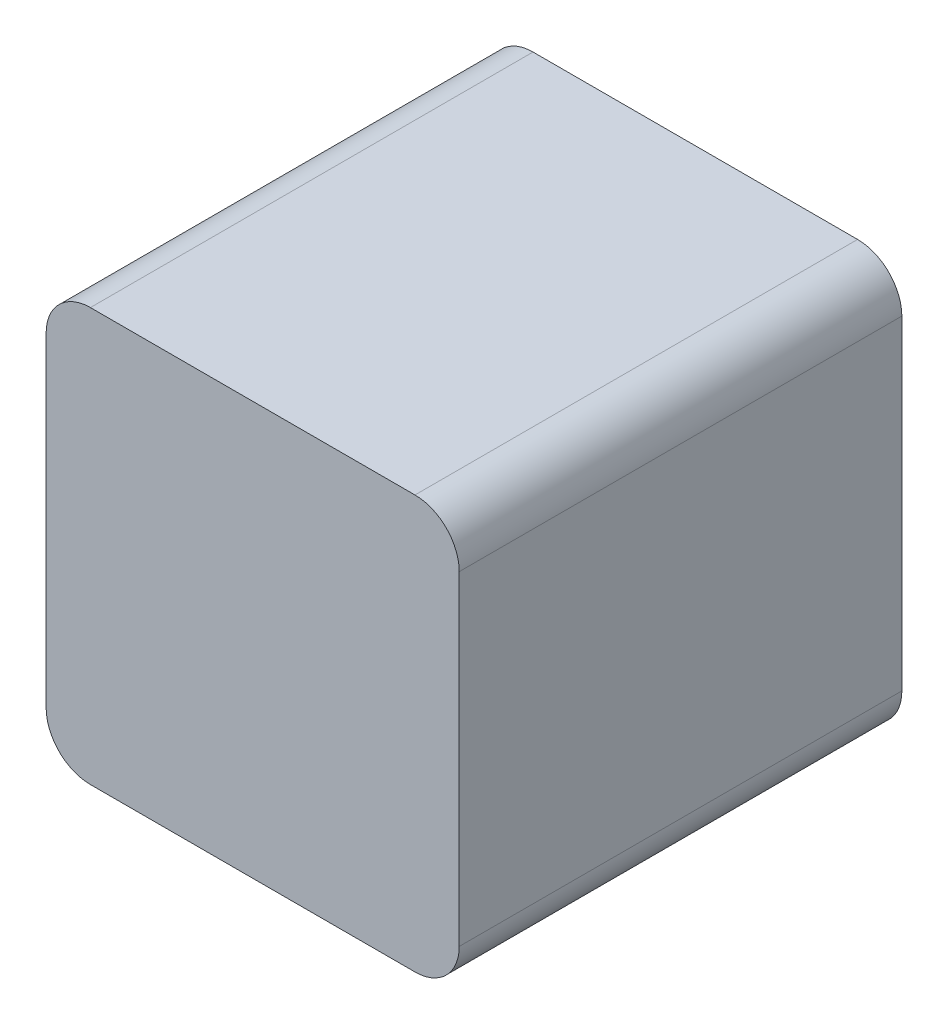
ISO-10303-21;
HEADER;
FILE_DESCRIPTION(('STEP AP214'),'2;1');
FILE_NAME('part.step','',(''),(''),'','','');
FILE_SCHEMA(('AUTOMOTIVE_DESIGN { 1 0 10303 214 1 1 1 1 }'));
ENDSEC;
DATA;
#1=APPLICATION_CONTEXT('core data for automotive mechanical design processes');
#2=APPLICATION_PROTOCOL_DEFINITION('international standard','automotive_design',2000,#1);
#3=PRODUCT_CONTEXT('',#1,'mechanical');
#4=PRODUCT('Part','Part','',(#3));
#5=PRODUCT_RELATED_PRODUCT_CATEGORY('part','',(#4));
#6=PRODUCT_DEFINITION_FORMATION('','',#4);
#7=PRODUCT_DEFINITION_CONTEXT('part definition',#1,'design');
#8=PRODUCT_DEFINITION('design','',#6,#7);
#9=PRODUCT_DEFINITION_SHAPE('','',#8);
#10=(LENGTH_UNIT() NAMED_UNIT(*) SI_UNIT(.MILLI.,.METRE.));
#11=(NAMED_UNIT(*) PLANE_ANGLE_UNIT() SI_UNIT($,.RADIAN.));
#12=(NAMED_UNIT(*) SI_UNIT($,.STERADIAN.) SOLID_ANGLE_UNIT());
#13=UNCERTAINTY_MEASURE_WITH_UNIT(LENGTH_MEASURE(1.E-05),#10,'distance_accuracy_value','');
#14=(GEOMETRIC_REPRESENTATION_CONTEXT(3) GLOBAL_UNCERTAINTY_ASSIGNED_CONTEXT((#13)) GLOBAL_UNIT_ASSIGNED_CONTEXT((#10,
#11,#12)) REPRESENTATION_CONTEXT('',''));
#15=CARTESIAN_POINT('',(0.,0.,0.));
#16=DIRECTION('',(0.,0.,1.));
#17=DIRECTION('',(1.,0.,0.));
#18=AXIS2_PLACEMENT_3D('',#15,#16,#17);
#19=CARTESIAN_POINT('',(-14.,-14.,15.));
#20=DIRECTION('',(0.,1.,0.));
#21=DIRECTION('',(0.,0.,1.));
#22=AXIS2_PLACEMENT_3D('',#19,#20,#21);
#23=PLANE('',#22);
#24=DIRECTION('',(1.,0.,0.));
#25=VECTOR('',#24,1.);
#26=CARTESIAN_POINT('',(-14.,-14.,-15.));
#27=LINE('',#26,#25);
#28=CARTESIAN_POINT('',(7.5,-14.,-15.));
#29=VERTEX_POINT('',#28);
#30=CARTESIAN_POINT('',(11.,-14.,-15.));
#31=VERTEX_POINT('',#30);
#32=EDGE_CURVE('E178',#29,#31,#27,.T.);
#33=ORIENTED_EDGE('',*,*,#32,.T.);
#34=DIRECTION('',(0.,0.,-1.));
#35=VECTOR('',#34,1.);
#36=CARTESIAN_POINT('',(11.,-14.,15.));
#37=LINE('',#36,#35);
#38=CARTESIAN_POINT('',(11.,-14.,15.));
#39=VERTEX_POINT('',#38);
#40=EDGE_CURVE('E198',#31,#39,#37,.F.);
#41=ORIENTED_EDGE('',*,*,#40,.T.);
#42=DIRECTION('',(1.,0.,0.));
#43=VECTOR('',#42,1.);
#44=CARTESIAN_POINT('',(-14.,-14.,15.));
#45=LINE('',#44,#43);
#46=CARTESIAN_POINT('',(-11.,-14.,15.));
#47=VERTEX_POINT('',#46);
#48=EDGE_CURVE('E167',#47,#39,#45,.T.);
#49=ORIENTED_EDGE('',*,*,#48,.F.);
#50=DIRECTION('',(0.,0.,-1.));
#51=VECTOR('',#50,1.);
#52=CARTESIAN_POINT('',(-11.,-14.,15.));
#53=LINE('',#52,#51);
#54=CARTESIAN_POINT('',(-11.,-14.,-15.));
#55=VERTEX_POINT('',#54);
#56=EDGE_CURVE('E195',#47,#55,#53,.T.);
#57=ORIENTED_EDGE('',*,*,#56,.T.);
#58=CARTESIAN_POINT('',(-7.5,-14.,-15.));
#59=VERTEX_POINT('',#58);
#60=EDGE_CURVE('E163',#55,#59,#27,.T.);
#61=ORIENTED_EDGE('',*,*,#60,.T.);
#62=DIRECTION('',(0.,0.,-1.));
#63=VECTOR('',#62,1.);
#64=CARTESIAN_POINT('',(-7.50000000000001,-14.,15.));
#65=LINE('',#64,#63);
#66=CARTESIAN_POINT('',(-7.5,-14.,-8.));
#67=VERTEX_POINT('',#66);
#68=EDGE_CURVE('E148',#67,#59,#65,.T.);
#69=ORIENTED_EDGE('',*,*,#68,.F.);
#70=DIRECTION('',(-1.,0.,0.));
#71=VECTOR('',#70,1.);
#72=CARTESIAN_POINT('',(-14.,-14.,-8.));
#73=LINE('',#72,#71);
#74=CARTESIAN_POINT('',(7.5,-14.,-8.));
#75=VERTEX_POINT('',#74);
#76=EDGE_CURVE('E170',#75,#67,#73,.T.);
#77=ORIENTED_EDGE('',*,*,#76,.F.);
#78=DIRECTION('',(0.,0.,1.));
#79=VECTOR('',#78,1.);
#80=CARTESIAN_POINT('',(7.5,-14.,15.));
#81=LINE('',#80,#79);
#82=EDGE_CURVE('E149',#29,#75,#81,.T.);
#83=ORIENTED_EDGE('',*,*,#82,.F.);
#84=EDGE_LOOP('',(#33,#41,#49,#57,#61,#69,#77,#83));
#85=FACE_BOUND('',#84,.T.);
#86=ADVANCED_FACE('F33',(#85),#23,.F.);
#87=CARTESIAN_POINT('',(14.,14.,15.));
#88=DIRECTION('',(-1.,0.,0.));
#89=DIRECTION('',(0.,-1.,0.));
#90=AXIS2_PLACEMENT_3D('',#87,#88,#89);
#91=PLANE('',#90);
#92=DIRECTION('',(0.,1.,0.));
#93=VECTOR('',#92,1.);
#94=CARTESIAN_POINT('',(14.,14.,15.));
#95=LINE('',#94,#93);
#96=CARTESIAN_POINT('',(14.,-11.,15.));
#97=VERTEX_POINT('',#96);
#98=CARTESIAN_POINT('',(14.,11.,15.));
#99=VERTEX_POINT('',#98);
#100=EDGE_CURVE('E159',#97,#99,#95,.T.);
#101=ORIENTED_EDGE('',*,*,#100,.F.);
#102=DIRECTION('',(0.,0.,-1.));
#103=VECTOR('',#102,1.);
#104=CARTESIAN_POINT('',(14.,-11.,15.));
#105=LINE('',#104,#103);
#106=CARTESIAN_POINT('',(14.,-11.,-15.));
#107=VERTEX_POINT('',#106);
#108=EDGE_CURVE('E184',#97,#107,#105,.T.);
#109=ORIENTED_EDGE('',*,*,#108,.T.);
#110=DIRECTION('',(0.,1.,0.));
#111=VECTOR('',#110,1.);
#112=CARTESIAN_POINT('',(14.,14.,-15.));
#113=LINE('',#112,#111);
#114=CARTESIAN_POINT('',(14.,11.,-15.));
#115=VERTEX_POINT('',#114);
#116=EDGE_CURVE('E158',#107,#115,#113,.T.);
#117=ORIENTED_EDGE('',*,*,#116,.T.);
#118=DIRECTION('',(0.,0.,-1.));
#119=VECTOR('',#118,1.);
#120=CARTESIAN_POINT('',(14.,11.,15.));
#121=LINE('',#120,#119);
#122=EDGE_CURVE('E182',#115,#99,#121,.F.);
#123=ORIENTED_EDGE('',*,*,#122,.T.);
#124=EDGE_LOOP('',(#101,#109,#117,#123));
#125=FACE_BOUND('',#124,.T.);
#126=ADVANCED_FACE('F239',(#125),#91,.F.);
#127=CARTESIAN_POINT('',(-14.,14.,15.));
#128=DIRECTION('',(0.,-1.,0.));
#129=DIRECTION('',(0.,0.,-1.));
#130=AXIS2_PLACEMENT_3D('',#127,#128,#129);
#131=PLANE('',#130);
#132=DIRECTION('',(-1.,0.,0.));
#133=VECTOR('',#132,1.);
#134=CARTESIAN_POINT('',(-14.,14.,-15.));
#135=LINE('',#134,#133);
#136=CARTESIAN_POINT('',(11.,14.,-15.));
#137=VERTEX_POINT('',#136);
#138=CARTESIAN_POINT('',(-11.,14.,-15.));
#139=VERTEX_POINT('',#138);
#140=EDGE_CURVE('E173',#137,#139,#135,.T.);
#141=ORIENTED_EDGE('',*,*,#140,.T.);
#142=DIRECTION('',(0.,0.,-1.));
#143=VECTOR('',#142,1.);
#144=CARTESIAN_POINT('',(-11.,14.,15.));
#145=LINE('',#144,#143);
#146=CARTESIAN_POINT('',(-11.,14.,15.));
#147=VERTEX_POINT('',#146);
#148=EDGE_CURVE('E11',#139,#147,#145,.F.);
#149=ORIENTED_EDGE('',*,*,#148,.T.);
#150=DIRECTION('',(-1.,0.,0.));
#151=VECTOR('',#150,1.);
#152=CARTESIAN_POINT('',(-14.,14.,15.));
#153=LINE('',#152,#151);
#154=CARTESIAN_POINT('',(11.,14.,15.));
#155=VERTEX_POINT('',#154);
#156=EDGE_CURVE('E162',#155,#147,#153,.T.);
#157=ORIENTED_EDGE('',*,*,#156,.F.);
#158=DIRECTION('',(0.,0.,-1.));
#159=VECTOR('',#158,1.);
#160=CARTESIAN_POINT('',(11.,14.,15.));
#161=LINE('',#160,#159);
#162=EDGE_CURVE('E41',#155,#137,#161,.T.);
#163=ORIENTED_EDGE('',*,*,#162,.T.);
#164=EDGE_LOOP('',(#141,#149,#157,#163));
#165=FACE_BOUND('',#164,.T.);
#166=ADVANCED_FACE('F215',(#165),#131,.F.);
#167=CARTESIAN_POINT('',(-14.,14.,15.));
#168=DIRECTION('',(1.,0.,0.));
#169=DIRECTION('',(0.,1.,0.));
#170=AXIS2_PLACEMENT_3D('',#167,#168,#169);
#171=PLANE('',#170);
#172=DIRECTION('',(0.,-1.,0.));
#173=VECTOR('',#172,1.);
#174=CARTESIAN_POINT('',(-14.,14.,-15.));
#175=LINE('',#174,#173);
#176=CARTESIAN_POINT('',(-14.,11.,-15.));
#177=VERTEX_POINT('',#176);
#178=CARTESIAN_POINT('',(-14.,-11.,-15.));
#179=VERTEX_POINT('',#178);
#180=EDGE_CURVE('E176',#177,#179,#175,.T.);
#181=ORIENTED_EDGE('',*,*,#180,.T.);
#182=DIRECTION('',(0.,0.,-1.));
#183=VECTOR('',#182,1.);
#184=CARTESIAN_POINT('',(-14.,-11.,15.));
#185=LINE('',#184,#183);
#186=CARTESIAN_POINT('',(-14.,-11.,15.));
#187=VERTEX_POINT('',#186);
#188=EDGE_CURVE('E48',#179,#187,#185,.F.);
#189=ORIENTED_EDGE('',*,*,#188,.T.);
#190=DIRECTION('',(0.,-1.,0.));
#191=VECTOR('',#190,1.);
#192=CARTESIAN_POINT('',(-14.,14.,15.));
#193=LINE('',#192,#191);
#194=CARTESIAN_POINT('',(-14.,11.,15.));
#195=VERTEX_POINT('',#194);
#196=EDGE_CURVE('E165',#195,#187,#193,.T.);
#197=ORIENTED_EDGE('',*,*,#196,.F.);
#198=DIRECTION('',(0.,0.,-1.));
#199=VECTOR('',#198,1.);
#200=CARTESIAN_POINT('',(-14.,11.,15.));
#201=LINE('',#200,#199);
#202=EDGE_CURVE('E207',#195,#177,#201,.T.);
#203=ORIENTED_EDGE('',*,*,#202,.T.);
#204=EDGE_LOOP('',(#181,#189,#197,#203));
#205=FACE_BOUND('',#204,.T.);
#206=ADVANCED_FACE('F223',(#205),#171,.F.);
#207=CARTESIAN_POINT('',(0.,0.,15.));
#208=DIRECTION('',(0.,0.,1.));
#209=DIRECTION('',(1.,0.,0.));
#210=AXIS2_PLACEMENT_3D('',#207,#208,#209);
#211=PLANE('',#210);
#212=ORIENTED_EDGE('',*,*,#48,.T.);
#213=CARTESIAN_POINT('',(11.,-11.,15.));
#214=DIRECTION('',(0.,0.,1.));
#215=DIRECTION('',(1.,0.,0.));
#216=AXIS2_PLACEMENT_3D('',#213,#214,#215);
#217=CIRCLE('',#216,3.);
#218=EDGE_CURVE('E205',#39,#97,#217,.T.);
#219=ORIENTED_EDGE('',*,*,#218,.T.);
#220=ORIENTED_EDGE('',*,*,#100,.T.);
#221=CARTESIAN_POINT('',(11.,11.,15.));
#222=DIRECTION('',(0.,0.,1.));
#223=DIRECTION('',(1.,0.,0.));
#224=AXIS2_PLACEMENT_3D('',#221,#222,#223);
#225=CIRCLE('',#224,3.);
#226=EDGE_CURVE('E200',#99,#155,#225,.T.);
#227=ORIENTED_EDGE('',*,*,#226,.T.);
#228=ORIENTED_EDGE('',*,*,#156,.T.);
#229=CARTESIAN_POINT('',(-11.,11.,15.));
#230=DIRECTION('',(0.,0.,1.));
#231=DIRECTION('',(1.,0.,0.));
#232=AXIS2_PLACEMENT_3D('',#229,#230,#231);
#233=CIRCLE('',#232,3.);
#234=EDGE_CURVE('E55',#147,#195,#233,.T.);
#235=ORIENTED_EDGE('',*,*,#234,.T.);
#236=ORIENTED_EDGE('',*,*,#196,.T.);
#237=CARTESIAN_POINT('',(-11.,-11.,15.));
#238=DIRECTION('',(0.,0.,1.));
#239=DIRECTION('',(1.,0.,0.));
#240=AXIS2_PLACEMENT_3D('',#237,#238,#239);
#241=CIRCLE('',#240,3.);
#242=EDGE_CURVE('E203',#187,#47,#241,.T.);
#243=ORIENTED_EDGE('',*,*,#242,.T.);
#244=EDGE_LOOP('',(#212,#219,#220,#227,#228,#235,#236,#243));
#245=FACE_BOUND('',#244,.T.);
#246=ADVANCED_FACE('F225',(#245),#211,.T.);
#247=CARTESIAN_POINT('',(0.,0.,-15.));
#248=DIRECTION('',(0.,0.,1.));
#249=DIRECTION('',(1.,0.,0.));
#250=AXIS2_PLACEMENT_3D('',#247,#248,#249);
#251=PLANE('',#250);
#252=ORIENTED_EDGE('',*,*,#116,.F.);
#253=CARTESIAN_POINT('',(11.,-11.,-15.));
#254=DIRECTION('',(0.,0.,1.));
#255=DIRECTION('',(1.,0.,0.));
#256=AXIS2_PLACEMENT_3D('',#253,#254,#255);
#257=CIRCLE('',#256,3.);
#258=EDGE_CURVE('E193',#107,#31,#257,.F.);
#259=ORIENTED_EDGE('',*,*,#258,.T.);
#260=ORIENTED_EDGE('',*,*,#32,.F.);
#261=DIRECTION('',(0.,1.,0.));
#262=VECTOR('',#261,1.);
#263=CARTESIAN_POINT('',(7.5,-15.5,-15.));
#264=LINE('',#263,#262);
#265=CARTESIAN_POINT('',(7.5,-15.5,-15.));
#266=VERTEX_POINT('',#265);
#267=EDGE_CURVE('E132',#266,#29,#264,.T.);
#268=ORIENTED_EDGE('',*,*,#267,.F.);
#269=DIRECTION('',(1.,0.,0.));
#270=VECTOR('',#269,1.);
#271=CARTESIAN_POINT('',(-7.5,-15.5,-15.));
#272=LINE('',#271,#270);
#273=CARTESIAN_POINT('',(-7.5,-15.5,-15.));
#274=VERTEX_POINT('',#273);
#275=EDGE_CURVE('E123',#274,#266,#272,.T.);
#276=ORIENTED_EDGE('',*,*,#275,.F.);
#277=DIRECTION('',(0.,1.,0.));
#278=VECTOR('',#277,1.);
#279=CARTESIAN_POINT('',(-7.5,-15.5,-15.));
#280=LINE('',#279,#278);
#281=EDGE_CURVE('E129',#274,#59,#280,.T.);
#282=ORIENTED_EDGE('',*,*,#281,.T.);
#283=ORIENTED_EDGE('',*,*,#60,.F.);
#284=CARTESIAN_POINT('',(-11.,-11.,-15.));
#285=DIRECTION('',(0.,0.,1.));
#286=DIRECTION('',(1.,0.,0.));
#287=AXIS2_PLACEMENT_3D('',#284,#285,#286);
#288=CIRCLE('',#287,3.);
#289=EDGE_CURVE('E191',#55,#179,#288,.F.);
#290=ORIENTED_EDGE('',*,*,#289,.T.);
#291=ORIENTED_EDGE('',*,*,#180,.F.);
#292=CARTESIAN_POINT('',(-11.,11.,-15.));
#293=DIRECTION('',(0.,0.,1.));
#294=DIRECTION('',(1.,0.,0.));
#295=AXIS2_PLACEMENT_3D('',#292,#293,#294);
#296=CIRCLE('',#295,3.);
#297=EDGE_CURVE('E189',#177,#139,#296,.F.);
#298=ORIENTED_EDGE('',*,*,#297,.T.);
#299=ORIENTED_EDGE('',*,*,#140,.F.);
#300=CARTESIAN_POINT('',(11.,11.,-15.));
#301=DIRECTION('',(0.,0.,1.));
#302=DIRECTION('',(1.,0.,0.));
#303=AXIS2_PLACEMENT_3D('',#300,#301,#302);
#304=CIRCLE('',#303,3.);
#305=EDGE_CURVE('E187',#137,#115,#304,.F.);
#306=ORIENTED_EDGE('',*,*,#305,.T.);
#307=EDGE_LOOP('',(#252,#259,#260,#268,#276,#282,#283,#290,#291,#298,#299,#306));
#308=FACE_BOUND('',#307,.T.);
#309=ADVANCED_FACE('F126',(#308),#251,.F.);
#310=CARTESIAN_POINT('',(-7.5,-15.5,-8.));
#311=DIRECTION('',(0.,0.,-1.));
#312=DIRECTION('',(-1.,0.,0.));
#313=AXIS2_PLACEMENT_3D('',#310,#311,#312);
#314=PLANE('',#313);
#315=DIRECTION('',(0.,1.,0.));
#316=VECTOR('',#315,1.);
#317=CARTESIAN_POINT('',(7.5,-15.5,-8.));
#318=LINE('',#317,#316);
#319=CARTESIAN_POINT('',(7.5,-15.5,-8.));
#320=VERTEX_POINT('',#319);
#321=EDGE_CURVE('E153',#320,#75,#318,.T.);
#322=ORIENTED_EDGE('',*,*,#321,.T.);
#323=ORIENTED_EDGE('',*,*,#76,.T.);
#324=DIRECTION('',(0.,1.,0.));
#325=VECTOR('',#324,1.);
#326=CARTESIAN_POINT('',(-7.5,-15.5,-8.));
#327=LINE('',#326,#325);
#328=CARTESIAN_POINT('',(-7.5,-15.5,-8.));
#329=VERTEX_POINT('',#328);
#330=EDGE_CURVE('E247',#329,#67,#327,.T.);
#331=ORIENTED_EDGE('',*,*,#330,.F.);
#332=DIRECTION('',(-1.,0.,0.));
#333=VECTOR('',#332,1.);
#334=CARTESIAN_POINT('',(-7.5,-15.5,-8.));
#335=LINE('',#334,#333);
#336=EDGE_CURVE('E141',#320,#329,#335,.T.);
#337=ORIENTED_EDGE('',*,*,#336,.F.);
#338=EDGE_LOOP('',(#322,#323,#331,#337));
#339=FACE_BOUND('',#338,.T.);
#340=ADVANCED_FACE('F246',(#339),#314,.F.);
#341=CARTESIAN_POINT('',(-7.5,-15.5,-8.));
#342=DIRECTION('',(1.,0.,0.));
#343=DIRECTION('',(0.,0.,-1.));
#344=AXIS2_PLACEMENT_3D('',#341,#342,#343);
#345=PLANE('',#344);
#346=ORIENTED_EDGE('',*,*,#330,.T.);
#347=ORIENTED_EDGE('',*,*,#68,.T.);
#348=ORIENTED_EDGE('',*,*,#281,.F.);
#349=DIRECTION('',(0.,0.,-1.));
#350=VECTOR('',#349,1.);
#351=CARTESIAN_POINT('',(-7.5,-15.5,-8.));
#352=LINE('',#351,#350);
#353=EDGE_CURVE('E136',#329,#274,#352,.T.);
#354=ORIENTED_EDGE('',*,*,#353,.F.);
#355=EDGE_LOOP('',(#346,#347,#348,#354));
#356=FACE_BOUND('',#355,.T.);
#357=ADVANCED_FACE('F147',(#356),#345,.F.);
#358=CARTESIAN_POINT('',(7.5,-15.5,-8.));
#359=DIRECTION('',(-1.,0.,0.));
#360=DIRECTION('',(0.,0.,1.));
#361=AXIS2_PLACEMENT_3D('',#358,#359,#360);
#362=PLANE('',#361);
#363=ORIENTED_EDGE('',*,*,#267,.T.);
#364=ORIENTED_EDGE('',*,*,#82,.T.);
#365=ORIENTED_EDGE('',*,*,#321,.F.);
#366=DIRECTION('',(0.,0.,1.));
#367=VECTOR('',#366,1.);
#368=CARTESIAN_POINT('',(7.5,-15.5,-8.));
#369=LINE('',#368,#367);
#370=EDGE_CURVE('E135',#266,#320,#369,.T.);
#371=ORIENTED_EDGE('',*,*,#370,.F.);
#372=EDGE_LOOP('',(#363,#364,#365,#371));
#373=FACE_BOUND('',#372,.T.);
#374=ADVANCED_FACE('F244',(#373),#362,.F.);
#375=CARTESIAN_POINT('',(0.,-15.5,0.));
#376=DIRECTION('',(0.,-1.,0.));
#377=DIRECTION('',(0.,0.,-1.));
#378=AXIS2_PLACEMENT_3D('',#375,#376,#377);
#379=PLANE('',#378);
#380=ORIENTED_EDGE('',*,*,#353,.T.);
#381=ORIENTED_EDGE('',*,*,#275,.T.);
#382=ORIENTED_EDGE('',*,*,#370,.T.);
#383=ORIENTED_EDGE('',*,*,#336,.T.);
#384=EDGE_LOOP('',(#380,#381,#382,#383));
#385=FACE_BOUND('',#384,.T.);
#386=ADVANCED_FACE('F139',(#385),#379,.T.);
#387=CARTESIAN_POINT('',(11.,-11.,15.));
#388=DIRECTION('',(0.,0.,-1.));
#389=DIRECTION('',(-1.,0.,0.));
#390=AXIS2_PLACEMENT_3D('',#387,#388,#389);
#391=CYLINDRICAL_SURFACE('',#390,3.);
#392=ORIENTED_EDGE('',*,*,#218,.F.);
#393=ORIENTED_EDGE('',*,*,#40,.F.);
#394=ORIENTED_EDGE('',*,*,#258,.F.);
#395=ORIENTED_EDGE('',*,*,#108,.F.);
#396=EDGE_LOOP('',(#392,#393,#394,#395));
#397=FACE_BOUND('',#396,.T.);
#398=ADVANCED_FACE('F237',(#397),#391,.T.);
#399=CARTESIAN_POINT('',(-11.,-11.,15.));
#400=DIRECTION('',(0.,0.,-1.));
#401=DIRECTION('',(-1.,0.,0.));
#402=AXIS2_PLACEMENT_3D('',#399,#400,#401);
#403=CYLINDRICAL_SURFACE('',#402,3.);
#404=ORIENTED_EDGE('',*,*,#242,.F.);
#405=ORIENTED_EDGE('',*,*,#188,.F.);
#406=ORIENTED_EDGE('',*,*,#289,.F.);
#407=ORIENTED_EDGE('',*,*,#56,.F.);
#408=EDGE_LOOP('',(#404,#405,#406,#407));
#409=FACE_BOUND('',#408,.T.);
#410=ADVANCED_FACE('F229',(#409),#403,.T.);
#411=CARTESIAN_POINT('',(-11.,11.,15.));
#412=DIRECTION('',(0.,0.,-1.));
#413=DIRECTION('',(-1.,0.,0.));
#414=AXIS2_PLACEMENT_3D('',#411,#412,#413);
#415=CYLINDRICAL_SURFACE('',#414,3.);
#416=ORIENTED_EDGE('',*,*,#234,.F.);
#417=ORIENTED_EDGE('',*,*,#148,.F.);
#418=ORIENTED_EDGE('',*,*,#297,.F.);
#419=ORIENTED_EDGE('',*,*,#202,.F.);
#420=EDGE_LOOP('',(#416,#417,#418,#419));
#421=FACE_BOUND('',#420,.T.);
#422=ADVANCED_FACE('F222',(#421),#415,.T.);
#423=CARTESIAN_POINT('',(11.,11.,15.));
#424=DIRECTION('',(0.,0.,-1.));
#425=DIRECTION('',(-1.,0.,0.));
#426=AXIS2_PLACEMENT_3D('',#423,#424,#425);
#427=CYLINDRICAL_SURFACE('',#426,3.);
#428=ORIENTED_EDGE('',*,*,#226,.F.);
#429=ORIENTED_EDGE('',*,*,#122,.F.);
#430=ORIENTED_EDGE('',*,*,#305,.F.);
#431=ORIENTED_EDGE('',*,*,#162,.F.);
#432=EDGE_LOOP('',(#428,#429,#430,#431));
#433=FACE_BOUND('',#432,.T.);
#434=ADVANCED_FACE('F35',(#433),#427,.T.);
#435=CLOSED_SHELL('',(#86,#126,#166,#206,#246,#309,#340,#357,#374,#386,#398,#410,#422,#434));
#436=MANIFOLD_SOLID_BREP('B2',#435);
#437=ADVANCED_BREP_SHAPE_REPRESENTATION('',(#18,#436),#14);
#438=SHAPE_DEFINITION_REPRESENTATION(#9,#437);
ENDSEC;
END-ISO-10303-21;
